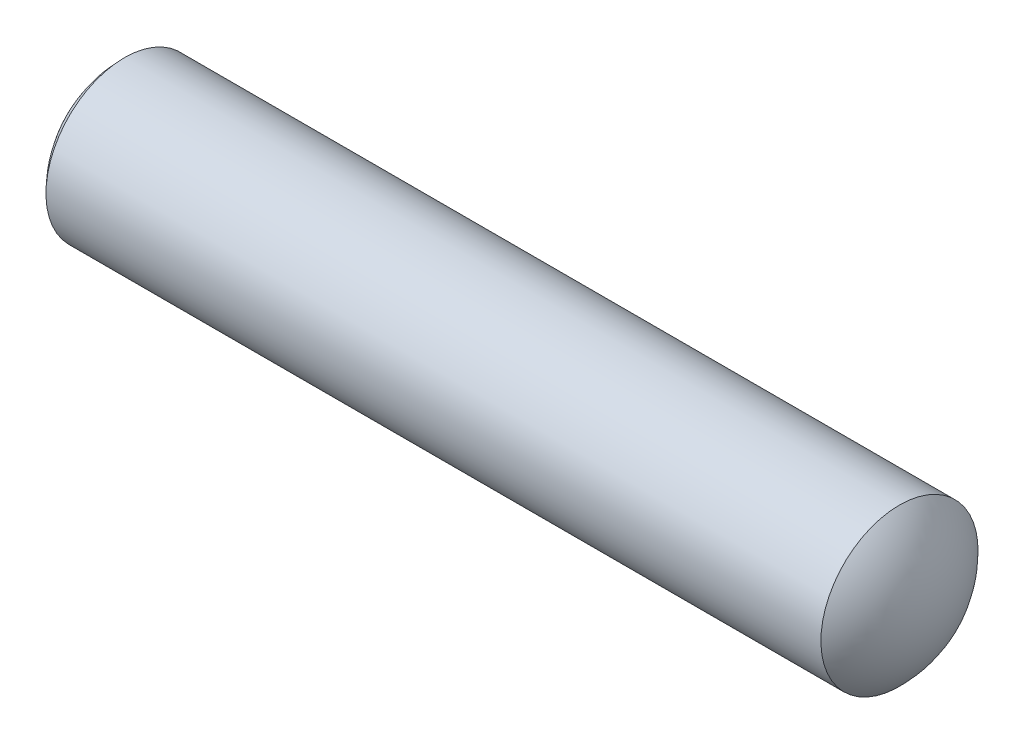
ISO-10303-21;
HEADER;
FILE_DESCRIPTION(('STEP AP214'),'2;1');
FILE_NAME('part.step','',(''),(''),'','','');
FILE_SCHEMA(('AUTOMOTIVE_DESIGN { 1 0 10303 214 1 1 1 1 }'));
ENDSEC;
DATA;
#1=APPLICATION_CONTEXT('core data for automotive mechanical design processes');
#2=APPLICATION_PROTOCOL_DEFINITION('international standard','automotive_design',2000,#1);
#3=PRODUCT_CONTEXT('',#1,'mechanical');
#4=PRODUCT('Part','Part','',(#3));
#5=PRODUCT_RELATED_PRODUCT_CATEGORY('part','',(#4));
#6=PRODUCT_DEFINITION_FORMATION('','',#4);
#7=PRODUCT_DEFINITION_CONTEXT('part definition',#1,'design');
#8=PRODUCT_DEFINITION('design','',#6,#7);
#9=PRODUCT_DEFINITION_SHAPE('','',#8);
#10=(LENGTH_UNIT() NAMED_UNIT(*) SI_UNIT(.MILLI.,.METRE.));
#11=(NAMED_UNIT(*) PLANE_ANGLE_UNIT() SI_UNIT($,.RADIAN.));
#12=(NAMED_UNIT(*) SI_UNIT($,.STERADIAN.) SOLID_ANGLE_UNIT());
#13=UNCERTAINTY_MEASURE_WITH_UNIT(LENGTH_MEASURE(1.E-05),#10,'distance_accuracy_value','');
#14=(GEOMETRIC_REPRESENTATION_CONTEXT(3) GLOBAL_UNCERTAINTY_ASSIGNED_CONTEXT((#13)) GLOBAL_UNIT_ASSIGNED_CONTEXT((#10,
#11,#12)) REPRESENTATION_CONTEXT('',''));
#15=CARTESIAN_POINT('',(0.,0.,0.));
#16=DIRECTION('',(0.,0.,1.));
#17=DIRECTION('',(1.,0.,0.));
#18=AXIS2_PLACEMENT_3D('',#15,#16,#17);
#19=CARTESIAN_POINT('',(15.1875,-13.9567193922089,16.1069128034251));
#20=DIRECTION('',(0.,-0.755749574354259,-0.654860733945285));
#21=DIRECTION('',(1.,0.,0.));
#22=AXIS2_PLACEMENT_3D('',#19,#20,#21);
#23=SPHERICAL_SURFACE('',#22,1.8375);
#24=CARTESIAN_POINT('',(15.1875,-13.9567193922089,16.1069128034251));
#25=DIRECTION('',(-1.,0.,0.));
#26=DIRECTION('',(0.,0.654860733945285,-0.755749574354258));
#27=AXIS2_PLACEMENT_3D('',#24,#25,#26);
#28=SPHERICAL_SURFACE('',#27,1.8375);
#29=CARTESIAN_POINT('',(16.4734821149612,-13.9567193922089,16.1069128034251));
#30=DIRECTION('',(-1.,0.,0.));
#31=DIRECTION('',(0.,0.654860733945285,-0.755749574354258));
#32=AXIS2_PLACEMENT_3D('',#29,#30,#31);
#33=CIRCLE('',#32,1.3125);
#34=CARTESIAN_POINT('',(16.4734821149612,-13.0972146789057,15.1149914870851));
#35=VERTEX_POINT('',#34);
#36=EDGE_CURVE('E11',#35,#35,#33,.T.);
#37=ORIENTED_EDGE('',*,*,#36,.F.);
#38=EDGE_LOOP('',(#37));
#39=FACE_BOUND('',#38,.T.);
#40=ADVANCED_FACE('F17',(#39),#28,.T.);
#41=CARTESIAN_POINT('',(10.,-13.9567193922089,16.1069128034251));
#42=DIRECTION('',(-1.,0.,0.));
#43=DIRECTION('',(0.,0.654860733945285,-0.755749574354258));
#44=AXIS2_PLACEMENT_3D('',#41,#42,#43);
#45=CYLINDRICAL_SURFACE('',#44,1.3125);
#46=CARTESIAN_POINT('',(3.52651788503884,-13.9567193922089,16.1069128034251));
#47=DIRECTION('',(-1.,0.,0.));
#48=DIRECTION('',(0.,0.654860733945285,-0.755749574354258));
#49=AXIS2_PLACEMENT_3D('',#46,#47,#48);
#50=CIRCLE('',#49,1.3125);
#51=CARTESIAN_POINT('',(3.52651788503884,-13.0972146789057,15.1149914870851));
#52=VERTEX_POINT('',#51);
#53=EDGE_CURVE('E21',#52,#52,#50,.T.);
#54=ORIENTED_EDGE('',*,*,#53,.F.);
#55=EDGE_LOOP('',(#54));
#56=FACE_BOUND('',#55,.T.);
#57=ORIENTED_EDGE('',*,*,#36,.T.);
#58=EDGE_LOOP('',(#57));
#59=FACE_BOUND('',#58,.T.);
#60=ADVANCED_FACE('F19',(#56,#59),#45,.T.);
#61=CARTESIAN_POINT('',(4.8125,-13.9567193922089,16.1069128034251));
#62=DIRECTION('',(0.,-0.755749574354258,-0.654860733945285));
#63=DIRECTION('',(-1.,0.,0.));
#64=AXIS2_PLACEMENT_3D('',#61,#62,#63);
#65=SPHERICAL_SURFACE('',#64,1.8375);
#66=CARTESIAN_POINT('',(4.8125,-13.9567193922089,16.1069128034251));
#67=DIRECTION('',(-1.,0.,0.));
#68=DIRECTION('',(0.,0.654860733945285,-0.755749574354258));
#69=AXIS2_PLACEMENT_3D('',#66,#67,#68);
#70=SPHERICAL_SURFACE('',#69,1.8375);
#71=ORIENTED_EDGE('',*,*,#53,.T.);
#72=EDGE_LOOP('',(#71));
#73=FACE_BOUND('',#72,.T.);
#74=ADVANCED_FACE('F40',(#73),#70,.T.);
#75=CLOSED_SHELL('',(#40,#60,#74));
#76=MANIFOLD_SOLID_BREP('B1',#75);
#77=ADVANCED_BREP_SHAPE_REPRESENTATION('',(#18,#76),#14);
#78=SHAPE_DEFINITION_REPRESENTATION(#9,#77);
ENDSEC;
END-ISO-10303-21;
